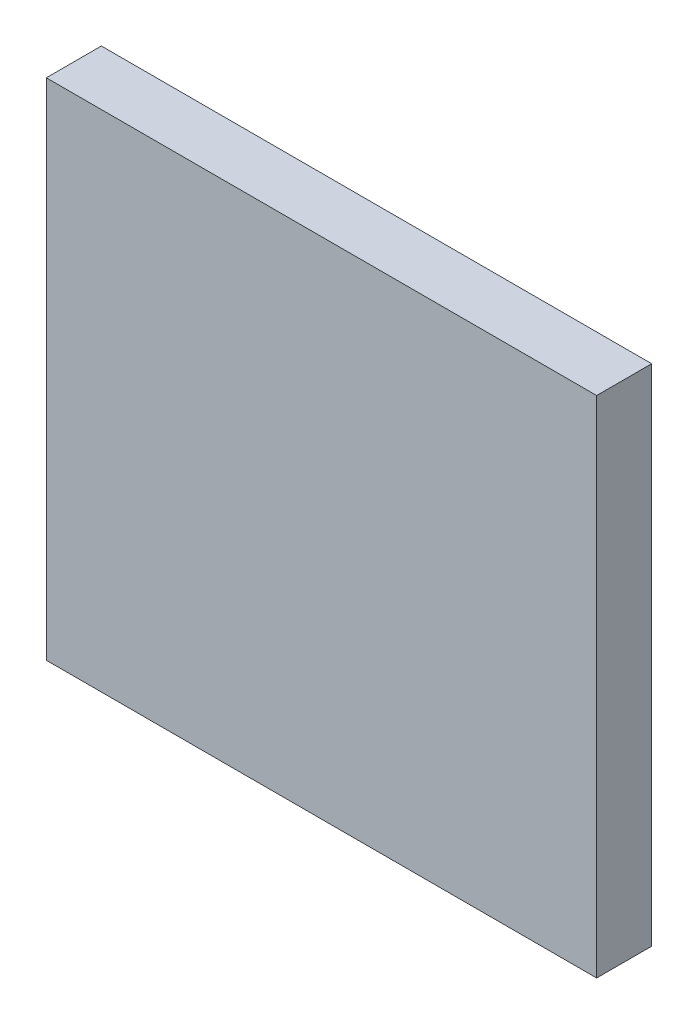
ISO-10303-21;
HEADER;
FILE_DESCRIPTION(('STEP AP214'),'2;1');
FILE_NAME('part.step','',(''),(''),'','','');
FILE_SCHEMA(('AUTOMOTIVE_DESIGN { 1 0 10303 214 1 1 1 1 }'));
ENDSEC;
DATA;
#1=APPLICATION_CONTEXT('core data for automotive mechanical design processes');
#2=APPLICATION_PROTOCOL_DEFINITION('international standard','automotive_design',2000,#1);
#3=PRODUCT_CONTEXT('',#1,'mechanical');
#4=PRODUCT('Part','Part','',(#3));
#5=PRODUCT_RELATED_PRODUCT_CATEGORY('part','',(#4));
#6=PRODUCT_DEFINITION_FORMATION('','',#4);
#7=PRODUCT_DEFINITION_CONTEXT('part definition',#1,'design');
#8=PRODUCT_DEFINITION('design','',#6,#7);
#9=PRODUCT_DEFINITION_SHAPE('','',#8);
#10=(LENGTH_UNIT() NAMED_UNIT(*) SI_UNIT(.MILLI.,.METRE.));
#11=(NAMED_UNIT(*) PLANE_ANGLE_UNIT() SI_UNIT($,.RADIAN.));
#12=(NAMED_UNIT(*) SI_UNIT($,.STERADIAN.) SOLID_ANGLE_UNIT());
#13=UNCERTAINTY_MEASURE_WITH_UNIT(LENGTH_MEASURE(1.E-05),#10,'distance_accuracy_value','');
#14=(GEOMETRIC_REPRESENTATION_CONTEXT(3) GLOBAL_UNCERTAINTY_ASSIGNED_CONTEXT((#13)) GLOBAL_UNIT_ASSIGNED_CONTEXT((#10,
#11,#12)) REPRESENTATION_CONTEXT('',''));
#15=CARTESIAN_POINT('',(0.,0.,0.));
#16=DIRECTION('',(0.,0.,1.));
#17=DIRECTION('',(1.,0.,0.));
#18=AXIS2_PLACEMENT_3D('',#15,#16,#17);
#19=CARTESIAN_POINT('',(-30.,19.7160094663511,6.));
#20=DIRECTION('',(1.,0.,0.));
#21=DIRECTION('',(0.,1.,0.));
#22=AXIS2_PLACEMENT_3D('',#19,#20,#21);
#23=PLANE('',#22);
#24=DIRECTION('',(0.,-1.,0.));
#25=VECTOR('',#24,1.);
#26=CARTESIAN_POINT('',(-30.,19.7160094663511,0.));
#27=LINE('',#26,#25);
#28=CARTESIAN_POINT('',(-30.,19.7160094663511,0.));
#29=VERTEX_POINT('',#28);
#30=CARTESIAN_POINT('',(-30.,-35.2839905336489,0.));
#31=VERTEX_POINT('',#30);
#32=EDGE_CURVE('E107',#29,#31,#27,.T.);
#33=ORIENTED_EDGE('',*,*,#32,.T.);
#34=DIRECTION('',(0.,0.,-1.));
#35=VECTOR('',#34,1.);
#36=CARTESIAN_POINT('',(-30.,-35.2839905336489,6.));
#37=LINE('',#36,#35);
#38=CARTESIAN_POINT('',(-30.,-35.2839905336489,6.));
#39=VERTEX_POINT('',#38);
#40=EDGE_CURVE('E11',#39,#31,#37,.T.);
#41=ORIENTED_EDGE('',*,*,#40,.F.);
#42=DIRECTION('',(0.,-1.,0.));
#43=VECTOR('',#42,1.);
#44=CARTESIAN_POINT('',(-30.,19.7160094663511,6.));
#45=LINE('',#44,#43);
#46=CARTESIAN_POINT('',(-30.,19.7160094663511,6.));
#47=VERTEX_POINT('',#46);
#48=EDGE_CURVE('E91',#47,#39,#45,.T.);
#49=ORIENTED_EDGE('',*,*,#48,.F.);
#50=DIRECTION('',(0.,0.,-1.));
#51=VECTOR('',#50,1.);
#52=CARTESIAN_POINT('',(-30.,19.7160094663511,6.));
#53=LINE('',#52,#51);
#54=EDGE_CURVE('E103',#47,#29,#53,.T.);
#55=ORIENTED_EDGE('',*,*,#54,.T.);
#56=EDGE_LOOP('',(#33,#41,#49,#55));
#57=FACE_BOUND('',#56,.T.);
#58=ADVANCED_FACE('F39',(#57),#23,.F.);
#59=CARTESIAN_POINT('',(-30.,-35.2839905336489,6.));
#60=DIRECTION('',(0.,1.,0.));
#61=DIRECTION('',(0.,0.,1.));
#62=AXIS2_PLACEMENT_3D('',#59,#60,#61);
#63=PLANE('',#62);
#64=DIRECTION('',(1.,0.,0.));
#65=VECTOR('',#64,1.);
#66=CARTESIAN_POINT('',(-30.,-35.2839905336489,0.));
#67=LINE('',#66,#65);
#68=CARTESIAN_POINT('',(30.,-35.2839905336489,0.));
#69=VERTEX_POINT('',#68);
#70=EDGE_CURVE('E96',#31,#69,#67,.T.);
#71=ORIENTED_EDGE('',*,*,#70,.T.);
#72=DIRECTION('',(0.,0.,-1.));
#73=VECTOR('',#72,1.);
#74=CARTESIAN_POINT('',(30.,-35.2839905336489,6.));
#75=LINE('',#74,#73);
#76=CARTESIAN_POINT('',(30.,-35.2839905336489,6.));
#77=VERTEX_POINT('',#76);
#78=EDGE_CURVE('E48',#77,#69,#75,.T.);
#79=ORIENTED_EDGE('',*,*,#78,.F.);
#80=DIRECTION('',(1.,0.,0.));
#81=VECTOR('',#80,1.);
#82=CARTESIAN_POINT('',(-30.,-35.2839905336489,6.));
#83=LINE('',#82,#81);
#84=EDGE_CURVE('E86',#39,#77,#83,.T.);
#85=ORIENTED_EDGE('',*,*,#84,.F.);
#86=ORIENTED_EDGE('',*,*,#40,.T.);
#87=EDGE_LOOP('',(#71,#79,#85,#86));
#88=FACE_BOUND('',#87,.T.);
#89=ADVANCED_FACE('F95',(#88),#63,.F.);
#90=CARTESIAN_POINT('',(30.,19.7160094663511,6.));
#91=DIRECTION('',(-1.,0.,0.));
#92=DIRECTION('',(0.,-1.,0.));
#93=AXIS2_PLACEMENT_3D('',#90,#91,#92);
#94=PLANE('',#93);
#95=DIRECTION('',(0.,1.,0.));
#96=VECTOR('',#95,1.);
#97=CARTESIAN_POINT('',(30.,19.7160094663511,0.));
#98=LINE('',#97,#96);
#99=CARTESIAN_POINT('',(30.,19.7160094663511,0.));
#100=VERTEX_POINT('',#99);
#101=EDGE_CURVE('E73',#69,#100,#98,.T.);
#102=ORIENTED_EDGE('',*,*,#101,.T.);
#103=DIRECTION('',(0.,0.,-1.));
#104=VECTOR('',#103,1.);
#105=CARTESIAN_POINT('',(30.,19.7160094663511,6.));
#106=LINE('',#105,#104);
#107=CARTESIAN_POINT('',(30.,19.7160094663511,6.));
#108=VERTEX_POINT('',#107);
#109=EDGE_CURVE('E98',#108,#100,#106,.T.);
#110=ORIENTED_EDGE('',*,*,#109,.F.);
#111=DIRECTION('',(0.,1.,0.));
#112=VECTOR('',#111,1.);
#113=CARTESIAN_POINT('',(30.,19.7160094663511,6.));
#114=LINE('',#113,#112);
#115=EDGE_CURVE('E89',#77,#108,#114,.T.);
#116=ORIENTED_EDGE('',*,*,#115,.F.);
#117=ORIENTED_EDGE('',*,*,#78,.T.);
#118=EDGE_LOOP('',(#102,#110,#116,#117));
#119=FACE_BOUND('',#118,.T.);
#120=ADVANCED_FACE('F99',(#119),#94,.F.);
#121=CARTESIAN_POINT('',(30.,19.7160094663511,6.));
#122=DIRECTION('',(0.,-1.,0.));
#123=DIRECTION('',(0.,0.,-1.));
#124=AXIS2_PLACEMENT_3D('',#121,#122,#123);
#125=PLANE('',#124);
#126=DIRECTION('',(-1.,0.,0.));
#127=VECTOR('',#126,1.);
#128=CARTESIAN_POINT('',(30.,19.7160094663511,0.));
#129=LINE('',#128,#127);
#130=EDGE_CURVE('E79',#100,#29,#129,.T.);
#131=ORIENTED_EDGE('',*,*,#130,.T.);
#132=ORIENTED_EDGE('',*,*,#54,.F.);
#133=DIRECTION('',(-1.,0.,0.));
#134=VECTOR('',#133,1.);
#135=CARTESIAN_POINT('',(30.,19.7160094663511,6.));
#136=LINE('',#135,#134);
#137=EDGE_CURVE('E56',#108,#47,#136,.T.);
#138=ORIENTED_EDGE('',*,*,#137,.F.);
#139=ORIENTED_EDGE('',*,*,#109,.T.);
#140=EDGE_LOOP('',(#131,#132,#138,#139));
#141=FACE_BOUND('',#140,.T.);
#142=ADVANCED_FACE('F120',(#141),#125,.F.);
#143=CARTESIAN_POINT('',(0.,0.,6.));
#144=DIRECTION('',(0.,0.,1.));
#145=DIRECTION('',(1.,0.,0.));
#146=AXIS2_PLACEMENT_3D('',#143,#144,#145);
#147=PLANE('',#146);
#148=ORIENTED_EDGE('',*,*,#48,.T.);
#149=ORIENTED_EDGE('',*,*,#84,.T.);
#150=ORIENTED_EDGE('',*,*,#115,.T.);
#151=ORIENTED_EDGE('',*,*,#137,.T.);
#152=EDGE_LOOP('',(#148,#149,#150,#151));
#153=FACE_BOUND('',#152,.T.);
#154=ADVANCED_FACE('F87',(#153),#147,.T.);
#155=CARTESIAN_POINT('',(0.,0.,0.));
#156=DIRECTION('',(0.,0.,1.));
#157=DIRECTION('',(1.,0.,0.));
#158=AXIS2_PLACEMENT_3D('',#155,#156,#157);
#159=PLANE('',#158);
#160=ORIENTED_EDGE('',*,*,#32,.F.);
#161=ORIENTED_EDGE('',*,*,#130,.F.);
#162=ORIENTED_EDGE('',*,*,#101,.F.);
#163=ORIENTED_EDGE('',*,*,#70,.F.);
#164=EDGE_LOOP('',(#160,#161,#162,#163));
#165=FACE_BOUND('',#164,.T.);
#166=ADVANCED_FACE('F123',(#165),#159,.F.);
#167=CLOSED_SHELL('',(#58,#89,#120,#142,#154,#166));
#168=MANIFOLD_SOLID_BREP('B2',#167);
#169=ADVANCED_BREP_SHAPE_REPRESENTATION('',(#18,#168),#14);
#170=SHAPE_DEFINITION_REPRESENTATION(#9,#169);
ENDSEC;
END-ISO-10303-21;
